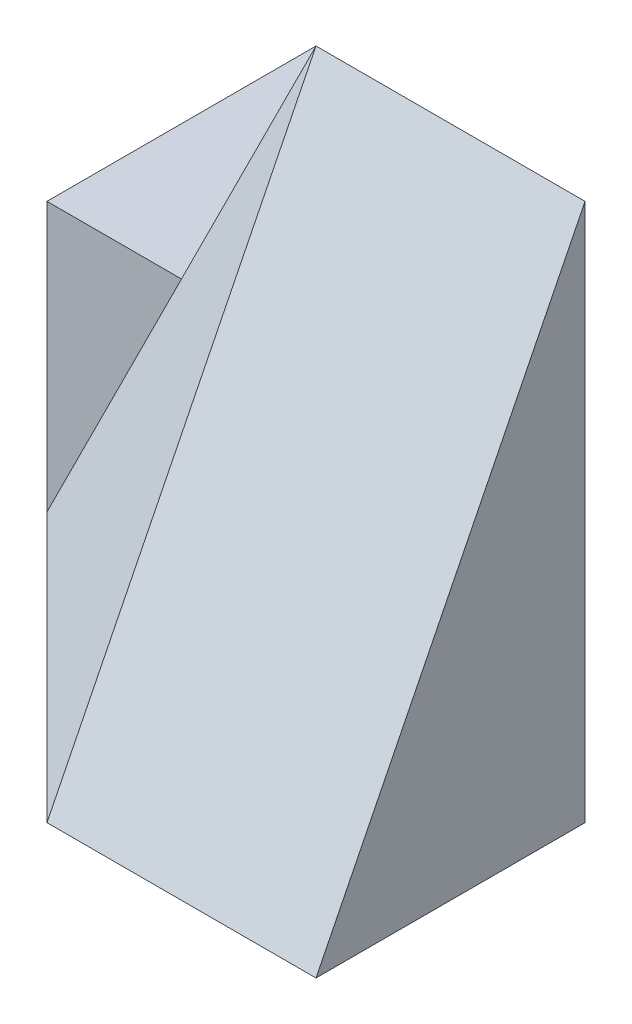
ISO-10303-21;
HEADER;
FILE_DESCRIPTION(('STEP AP214'),'2;1');
FILE_NAME('part.step','',(''),(''),'','','');
FILE_SCHEMA(('AUTOMOTIVE_DESIGN { 1 0 10303 214 1 1 1 1 }'));
ENDSEC;
DATA;
#1=APPLICATION_CONTEXT('core data for automotive mechanical design processes');
#2=APPLICATION_PROTOCOL_DEFINITION('international standard','automotive_design',2000,#1);
#3=PRODUCT_CONTEXT('',#1,'mechanical');
#4=PRODUCT('Part','Part','',(#3));
#5=PRODUCT_RELATED_PRODUCT_CATEGORY('part','',(#4));
#6=PRODUCT_DEFINITION_FORMATION('','',#4);
#7=PRODUCT_DEFINITION_CONTEXT('part definition',#1,'design');
#8=PRODUCT_DEFINITION('design','',#6,#7);
#9=PRODUCT_DEFINITION_SHAPE('','',#8);
#10=(LENGTH_UNIT() NAMED_UNIT(*) SI_UNIT(.MILLI.,.METRE.));
#11=(NAMED_UNIT(*) PLANE_ANGLE_UNIT() SI_UNIT($,.RADIAN.));
#12=(NAMED_UNIT(*) SI_UNIT($,.STERADIAN.) SOLID_ANGLE_UNIT());
#13=UNCERTAINTY_MEASURE_WITH_UNIT(LENGTH_MEASURE(1.E-05),#10,'distance_accuracy_value','');
#14=(GEOMETRIC_REPRESENTATION_CONTEXT(3) GLOBAL_UNCERTAINTY_ASSIGNED_CONTEXT((#13)) GLOBAL_UNIT_ASSIGNED_CONTEXT((#10,
#11,#12)) REPRESENTATION_CONTEXT('',''));
#15=CARTESIAN_POINT('',(0.,0.,0.));
#16=DIRECTION('',(0.,0.,1.));
#17=DIRECTION('',(1.,0.,0.));
#18=AXIS2_PLACEMENT_3D('',#15,#16,#17);
#19=CARTESIAN_POINT('',(0.,20.,40.));
#20=DIRECTION('',(0.,-1.,0.));
#21=DIRECTION('',(0.,0.,-1.));
#22=AXIS2_PLACEMENT_3D('',#19,#20,#21);
#23=PLANE('',#22);
#24=DIRECTION('',(0.,0.,-1.));
#25=VECTOR('',#24,1.);
#26=CARTESIAN_POINT('',(20.,20.,40.));
#27=LINE('',#26,#25);
#28=CARTESIAN_POINT('',(20.,20.,20.));
#29=VERTEX_POINT('',#28);
#30=CARTESIAN_POINT('',(20.,20.,0.));
#31=VERTEX_POINT('',#30);
#32=EDGE_CURVE('E164',#29,#31,#27,.T.);
#33=ORIENTED_EDGE('',*,*,#32,.F.);
#34=DIRECTION('',(1.,0.,0.));
#35=VECTOR('',#34,1.);
#36=CARTESIAN_POINT('',(20.,20.,20.));
#37=LINE('',#36,#35);
#38=CARTESIAN_POINT('',(40.,20.,20.));
#39=VERTEX_POINT('',#38);
#40=EDGE_CURVE('E48',#29,#39,#37,.T.);
#41=ORIENTED_EDGE('',*,*,#40,.T.);
#42=DIRECTION('',(0.707106781186548,0.,0.707106781186548));
#43=VECTOR('',#42,1.);
#44=CARTESIAN_POINT('',(40.,20.,20.));
#45=LINE('',#44,#43);
#46=EDGE_CURVE('E11',#31,#39,#45,.T.);
#47=ORIENTED_EDGE('',*,*,#46,.F.);
#48=EDGE_LOOP('',(#33,#41,#47));
#49=FACE_BOUND('',#48,.T.);
#50=ADVANCED_FACE('F33',(#49),#23,.F.);
#51=CARTESIAN_POINT('',(0.,0.,40.));
#52=DIRECTION('',(0.,1.,0.));
#53=DIRECTION('',(0.,0.,1.));
#54=AXIS2_PLACEMENT_3D('',#51,#52,#53);
#55=PLANE('',#54);
#56=DIRECTION('',(1.,0.,0.));
#57=VECTOR('',#56,1.);
#58=CARTESIAN_POINT('',(0.,0.,0.));
#59=LINE('',#58,#57);
#60=CARTESIAN_POINT('',(0.,0.,0.));
#61=VERTEX_POINT('',#60);
#62=CARTESIAN_POINT('',(20.,0.,0.));
#63=VERTEX_POINT('',#62);
#64=EDGE_CURVE('E108',#61,#63,#59,.T.);
#65=ORIENTED_EDGE('',*,*,#64,.T.);
#66=DIRECTION('',(0.707106781186548,0.,0.707106781186547));
#67=VECTOR('',#66,1.);
#68=CARTESIAN_POINT('',(40.,0.,20.));
#69=LINE('',#68,#67);
#70=CARTESIAN_POINT('',(40.,0.,20.));
#71=VERTEX_POINT('',#70);
#72=EDGE_CURVE('E122',#63,#71,#69,.T.);
#73=ORIENTED_EDGE('',*,*,#72,.T.);
#74=DIRECTION('',(0.,0.,-1.));
#75=VECTOR('',#74,1.);
#76=CARTESIAN_POINT('',(40.,0.,40.));
#77=LINE('',#76,#75);
#78=CARTESIAN_POINT('',(40.,0.,40.));
#79=VERTEX_POINT('',#78);
#80=EDGE_CURVE('E107',#79,#71,#77,.T.);
#81=ORIENTED_EDGE('',*,*,#80,.F.);
#82=DIRECTION('',(1.,0.,0.));
#83=VECTOR('',#82,1.);
#84=CARTESIAN_POINT('',(0.,0.,40.));
#85=LINE('',#84,#83);
#86=CARTESIAN_POINT('',(20.,0.,40.));
#87=VERTEX_POINT('',#86);
#88=EDGE_CURVE('E96',#87,#79,#85,.T.);
#89=ORIENTED_EDGE('',*,*,#88,.F.);
#90=DIRECTION('',(0.707106781186547,0.,0.707106781186548));
#91=VECTOR('',#90,1.);
#92=CARTESIAN_POINT('',(0.,0.,20.));
#93=LINE('',#92,#91);
#94=CARTESIAN_POINT('',(0.,0.,20.));
#95=VERTEX_POINT('',#94);
#96=EDGE_CURVE('E139',#95,#87,#93,.T.);
#97=ORIENTED_EDGE('',*,*,#96,.F.);
#98=DIRECTION('',(0.,0.,-1.));
#99=VECTOR('',#98,1.);
#100=CARTESIAN_POINT('',(0.,0.,40.));
#101=LINE('',#100,#99);
#102=EDGE_CURVE('E41',#95,#61,#101,.T.);
#103=ORIENTED_EDGE('',*,*,#102,.T.);
#104=EDGE_LOOP('',(#65,#73,#81,#89,#97,#103));
#105=FACE_BOUND('',#104,.T.);
#106=ADVANCED_FACE('F120',(#105),#55,.F.);
#107=CARTESIAN_POINT('',(0.,0.,40.));
#108=DIRECTION('',(1.,0.,0.));
#109=DIRECTION('',(0.,0.,-1.));
#110=AXIS2_PLACEMENT_3D('',#107,#108,#109);
#111=PLANE('',#110);
#112=DIRECTION('',(0.,1.,0.));
#113=VECTOR('',#112,1.);
#114=CARTESIAN_POINT('',(0.,-20.,20.));
#115=LINE('',#114,#113);
#116=CARTESIAN_POINT('',(0.,20.,20.));
#117=VERTEX_POINT('',#116);
#118=EDGE_CURVE('E131',#95,#117,#115,.T.);
#119=ORIENTED_EDGE('',*,*,#118,.T.);
#120=DIRECTION('',(0.,0.,1.));
#121=VECTOR('',#120,1.);
#122=CARTESIAN_POINT('',(0.,20.,0.));
#123=LINE('',#122,#121);
#124=CARTESIAN_POINT('',(0.,20.,0.));
#125=VERTEX_POINT('',#124);
#126=EDGE_CURVE('E155',#125,#117,#123,.T.);
#127=ORIENTED_EDGE('',*,*,#126,.F.);
#128=DIRECTION('',(0.,-1.,0.));
#129=VECTOR('',#128,1.);
#130=CARTESIAN_POINT('',(0.,0.,0.));
#131=LINE('',#130,#129);
#132=EDGE_CURVE('E137',#125,#61,#131,.T.);
#133=ORIENTED_EDGE('',*,*,#132,.T.);
#134=ORIENTED_EDGE('',*,*,#102,.F.);
#135=EDGE_LOOP('',(#119,#127,#133,#134));
#136=FACE_BOUND('',#135,.T.);
#137=ADVANCED_FACE('F35',(#136),#111,.F.);
#138=CARTESIAN_POINT('',(40.,0.,40.));
#139=DIRECTION('',(-1.,0.,0.));
#140=DIRECTION('',(0.,0.,1.));
#141=AXIS2_PLACEMENT_3D('',#138,#139,#140);
#142=PLANE('',#141);
#143=DIRECTION('',(0.,1.,0.));
#144=VECTOR('',#143,1.);
#145=CARTESIAN_POINT('',(40.,20.,20.));
#146=LINE('',#145,#144);
#147=CARTESIAN_POINT('',(40.,40.,20.));
#148=VERTEX_POINT('',#147);
#149=EDGE_CURVE('E114',#39,#148,#146,.T.);
#150=ORIENTED_EDGE('',*,*,#149,.T.);
#151=DIRECTION('',(0.,-0.894427190999916,0.447213595499958));
#152=VECTOR('',#151,1.);
#153=CARTESIAN_POINT('',(40.,40.,20.));
#154=LINE('',#153,#152);
#155=EDGE_CURVE('E99',#148,#79,#154,.T.);
#156=ORIENTED_EDGE('',*,*,#155,.T.);
#157=ORIENTED_EDGE('',*,*,#80,.T.);
#158=DIRECTION('',(0.,1.,0.));
#159=VECTOR('',#158,1.);
#160=CARTESIAN_POINT('',(40.,0.,20.));
#161=LINE('',#160,#159);
#162=EDGE_CURVE('E159',#71,#39,#161,.T.);
#163=ORIENTED_EDGE('',*,*,#162,.T.);
#164=EDGE_LOOP('',(#150,#156,#157,#163));
#165=FACE_BOUND('',#164,.T.);
#166=ADVANCED_FACE('F112',(#165),#142,.F.);
#167=CARTESIAN_POINT('',(0.,0.,0.));
#168=DIRECTION('',(0.,0.,-1.));
#169=DIRECTION('',(-1.,0.,0.));
#170=AXIS2_PLACEMENT_3D('',#167,#168,#169);
#171=PLANE('',#170);
#172=DIRECTION('',(1.,0.,0.));
#173=VECTOR('',#172,1.);
#174=CARTESIAN_POINT('',(0.,20.,0.));
#175=LINE('',#174,#173);
#176=CARTESIAN_POINT('',(10.,20.,0.));
#177=VERTEX_POINT('',#176);
#178=EDGE_CURVE('E153',#177,#31,#175,.T.);
#179=ORIENTED_EDGE('',*,*,#178,.T.);
#180=DIRECTION('',(0.,-1.,0.));
#181=VECTOR('',#180,1.);
#182=CARTESIAN_POINT('',(20.,40.,0.));
#183=LINE('',#182,#181);
#184=EDGE_CURVE('E130',#31,#63,#183,.T.);
#185=ORIENTED_EDGE('',*,*,#184,.T.);
#186=ORIENTED_EDGE('',*,*,#64,.F.);
#187=ORIENTED_EDGE('',*,*,#132,.F.);
#188=DIRECTION('',(1.,0.,0.));
#189=VECTOR('',#188,1.);
#190=CARTESIAN_POINT('',(0.,20.,0.));
#191=LINE('',#190,#189);
#192=EDGE_CURVE('E152',#125,#177,#191,.T.);
#193=ORIENTED_EDGE('',*,*,#192,.T.);
#194=EDGE_LOOP('',(#179,#185,#186,#187,#193));
#195=FACE_BOUND('',#194,.T.);
#196=ADVANCED_FACE('F150',(#195),#171,.T.);
#197=CARTESIAN_POINT('',(0.,-20.,20.));
#198=DIRECTION('',(0.,0.,1.));
#199=DIRECTION('',(1.,0.,0.));
#200=AXIS2_PLACEMENT_3D('',#197,#198,#199);
#201=PLANE('',#200);
#202=DIRECTION('',(1.,0.,0.));
#203=VECTOR('',#202,1.);
#204=CARTESIAN_POINT('',(0.,20.,20.));
#205=LINE('',#204,#203);
#206=CARTESIAN_POINT('',(9.99999999999999,20.,20.));
#207=VERTEX_POINT('',#206);
#208=EDGE_CURVE('E56',#117,#207,#205,.T.);
#209=ORIENTED_EDGE('',*,*,#208,.F.);
#210=ORIENTED_EDGE('',*,*,#118,.F.);
#211=DIRECTION('',(-0.447213595499959,-0.894427190999916,0.));
#212=VECTOR('',#211,1.);
#213=CARTESIAN_POINT('',(20.,39.9999999999999,20.));
#214=LINE('',#213,#212);
#215=EDGE_CURVE('E166',#207,#95,#214,.T.);
#216=ORIENTED_EDGE('',*,*,#215,.F.);
#217=EDGE_LOOP('',(#209,#210,#216));
#218=FACE_BOUND('',#217,.T.);
#219=ADVANCED_FACE('F172',(#218),#201,.T.);
#220=CARTESIAN_POINT('',(40.,40.,20.));
#221=DIRECTION('',(-0.707106781186548,0.,0.707106781186548));
#222=DIRECTION('',(0.707106781186548,0.,0.707106781186548));
#223=AXIS2_PLACEMENT_3D('',#220,#221,#222);
#224=PLANE('',#223);
#225=ORIENTED_EDGE('',*,*,#184,.F.);
#226=ORIENTED_EDGE('',*,*,#46,.T.);
#227=ORIENTED_EDGE('',*,*,#162,.F.);
#228=ORIENTED_EDGE('',*,*,#72,.F.);
#229=EDGE_LOOP('',(#225,#226,#227,#228));
#230=FACE_BOUND('',#229,.T.);
#231=ADVANCED_FACE('F190',(#230),#224,.F.);
#232=CARTESIAN_POINT('',(-8.8888888888889,4.44444444444445,8.88888888888889));
#233=DIRECTION('',(-0.666666666666667,0.333333333333333,0.666666666666666));
#234=DIRECTION('',(0.707106781186547,0.,0.707106781186548));
#235=AXIS2_PLACEMENT_3D('',#232,#233,#234);
#236=PLANE('',#235);
#237=CARTESIAN_POINT('',(20.,40.,20.));
#238=VERTEX_POINT('',#237);
#239=EDGE_CURVE('E143',#238,#207,#214,.T.);
#240=ORIENTED_EDGE('',*,*,#239,.T.);
#241=ORIENTED_EDGE('',*,*,#215,.T.);
#242=ORIENTED_EDGE('',*,*,#96,.T.);
#243=DIRECTION('',(0.,0.894427190999916,-0.447213595499958));
#244=VECTOR('',#243,1.);
#245=CARTESIAN_POINT('',(20.,0.,40.));
#246=LINE('',#245,#244);
#247=EDGE_CURVE('E102',#87,#238,#246,.T.);
#248=ORIENTED_EDGE('',*,*,#247,.T.);
#249=EDGE_LOOP('',(#240,#241,#242,#248));
#250=FACE_BOUND('',#249,.T.);
#251=ADVANCED_FACE('F169',(#250),#236,.T.);
#252=CARTESIAN_POINT('',(20.,0.,0.));
#253=DIRECTION('',(-1.,0.,0.));
#254=DIRECTION('',(0.,0.,1.));
#255=AXIS2_PLACEMENT_3D('',#252,#253,#254);
#256=PLANE('',#255);
#257=ORIENTED_EDGE('',*,*,#32,.T.);
#258=DIRECTION('',(0.,-0.707106781186548,-0.707106781186548));
#259=VECTOR('',#258,1.);
#260=CARTESIAN_POINT('',(20.,10.,-10.));
#261=LINE('',#260,#259);
#262=EDGE_CURVE('E116',#238,#31,#261,.T.);
#263=ORIENTED_EDGE('',*,*,#262,.F.);
#264=DIRECTION('',(0.,-1.,0.));
#265=VECTOR('',#264,1.);
#266=CARTESIAN_POINT('',(20.,20.,20.));
#267=LINE('',#266,#265);
#268=EDGE_CURVE('E336',#238,#29,#267,.T.);
#269=ORIENTED_EDGE('',*,*,#268,.T.);
#270=EDGE_LOOP('',(#257,#263,#269));
#271=FACE_BOUND('',#270,.T.);
#272=ADVANCED_FACE('F196',(#271),#256,.F.);
#273=CARTESIAN_POINT('',(0.,0.,0.));
#274=DIRECTION('',(0.894427190999916,-0.447213595499959,0.));
#275=DIRECTION('',(0.447213595499959,0.894427190999916,0.));
#276=AXIS2_PLACEMENT_3D('',#273,#274,#275);
#277=PLANE('',#276);
#278=ORIENTED_EDGE('',*,*,#239,.F.);
#279=DIRECTION('',(-0.333333333333334,-0.666666666666667,-0.666666666666667));
#280=VECTOR('',#279,1.);
#281=CARTESIAN_POINT('',(4.44444444444445,8.88888888888889,-11.1111111111111));
#282=LINE('',#281,#280);
#283=EDGE_CURVE('E331',#238,#177,#282,.T.);
#284=ORIENTED_EDGE('',*,*,#283,.T.);
#285=DIRECTION('',(0.,0.,1.));
#286=VECTOR('',#285,1.);
#287=CARTESIAN_POINT('',(10.,20.,0.));
#288=LINE('',#287,#286);
#289=EDGE_CURVE('E157',#177,#207,#288,.T.);
#290=ORIENTED_EDGE('',*,*,#289,.T.);
#291=EDGE_LOOP('',(#278,#284,#290));
#292=FACE_BOUND('',#291,.T.);
#293=ADVANCED_FACE('F199',(#292),#277,.F.);
#294=CARTESIAN_POINT('',(0.,20.,0.));
#295=DIRECTION('',(0.,-1.,0.));
#296=DIRECTION('',(1.,0.,0.));
#297=AXIS2_PLACEMENT_3D('',#294,#295,#296);
#298=PLANE('',#297);
#299=ORIENTED_EDGE('',*,*,#208,.T.);
#300=ORIENTED_EDGE('',*,*,#289,.F.);
#301=ORIENTED_EDGE('',*,*,#192,.F.);
#302=ORIENTED_EDGE('',*,*,#126,.T.);
#303=EDGE_LOOP('',(#299,#300,#301,#302));
#304=FACE_BOUND('',#303,.T.);
#305=ADVANCED_FACE('F201',(#304),#298,.F.);
#306=CARTESIAN_POINT('',(0.,0.,20.));
#307=DIRECTION('',(0.,0.,-1.));
#308=DIRECTION('',(-1.,0.,0.));
#309=AXIS2_PLACEMENT_3D('',#306,#307,#308);
#310=PLANE('',#309);
#311=ORIENTED_EDGE('',*,*,#268,.F.);
#312=DIRECTION('',(-1.,0.,0.));
#313=VECTOR('',#312,1.);
#314=CARTESIAN_POINT('',(20.,40.,20.));
#315=LINE('',#314,#313);
#316=EDGE_CURVE('E340',#148,#238,#315,.T.);
#317=ORIENTED_EDGE('',*,*,#316,.F.);
#318=ORIENTED_EDGE('',*,*,#149,.F.);
#319=ORIENTED_EDGE('',*,*,#40,.F.);
#320=EDGE_LOOP('',(#311,#317,#318,#319));
#321=FACE_BOUND('',#320,.T.);
#322=ADVANCED_FACE('F204',(#321),#310,.T.);
#323=CARTESIAN_POINT('',(0.,10.,-10.));
#324=DIRECTION('',(0.,-0.707106781186548,0.707106781186548));
#325=DIRECTION('',(0.,-0.707106781186548,-0.707106781186548));
#326=AXIS2_PLACEMENT_3D('',#323,#324,#325);
#327=PLANE('',#326);
#328=ORIENTED_EDGE('',*,*,#262,.T.);
#329=ORIENTED_EDGE('',*,*,#178,.F.);
#330=ORIENTED_EDGE('',*,*,#283,.F.);
#331=EDGE_LOOP('',(#328,#329,#330));
#332=FACE_BOUND('',#331,.T.);
#333=ADVANCED_FACE('F210',(#332),#327,.F.);
#334=CARTESIAN_POINT('',(40.,40.,20.));
#335=DIRECTION('',(0.,-0.447213595499958,-0.894427190999916));
#336=DIRECTION('',(0.,0.894427190999916,-0.447213595499958));
#337=AXIS2_PLACEMENT_3D('',#334,#335,#336);
#338=PLANE('',#337);
#339=ORIENTED_EDGE('',*,*,#247,.F.);
#340=ORIENTED_EDGE('',*,*,#88,.T.);
#341=ORIENTED_EDGE('',*,*,#155,.F.);
#342=ORIENTED_EDGE('',*,*,#316,.T.);
#343=EDGE_LOOP('',(#339,#340,#341,#342));
#344=FACE_BOUND('',#343,.T.);
#345=ADVANCED_FACE('F98',(#344),#338,.F.);
#346=CLOSED_SHELL('',(#50,#106,#137,#166,#196,#219,#231,#251,#272,#293,#305,#322,#333,#345));
#347=MANIFOLD_SOLID_BREP('B2',#346);
#348=ADVANCED_BREP_SHAPE_REPRESENTATION('',(#18,#347),#14);
#349=SHAPE_DEFINITION_REPRESENTATION(#9,#348);
ENDSEC;
END-ISO-10303-21;
